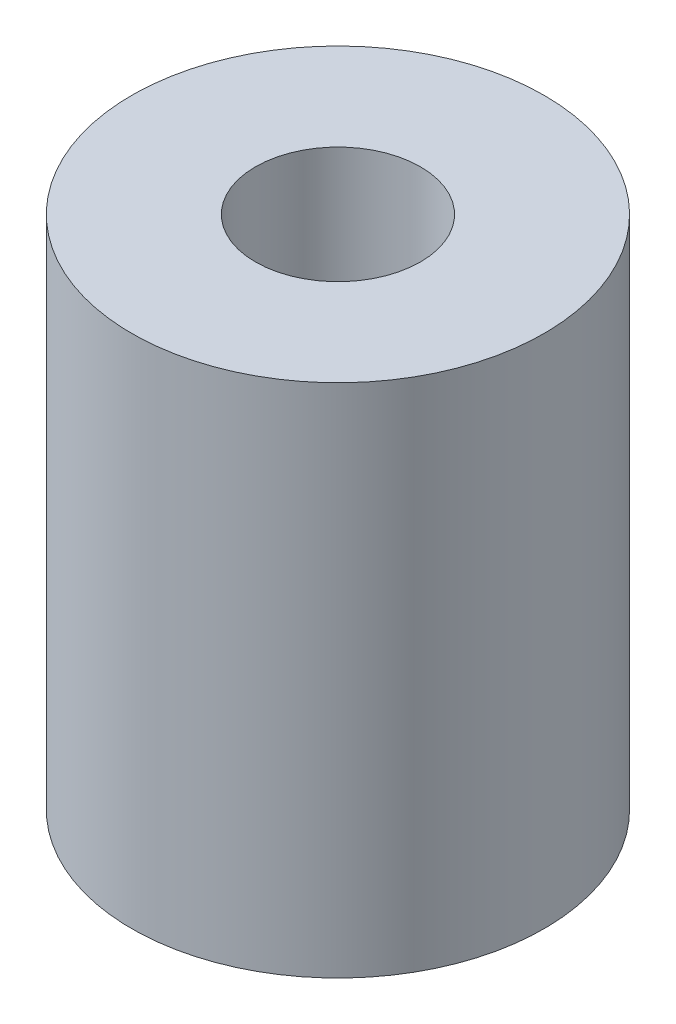
ISO-10303-21;
HEADER;
FILE_DESCRIPTION(('STEP AP214'),'2;1');
FILE_NAME('part.step','',(''),(''),'','','');
FILE_SCHEMA(('AUTOMOTIVE_DESIGN { 1 0 10303 214 1 1 1 1 }'));
ENDSEC;
DATA;
#1=APPLICATION_CONTEXT('core data for automotive mechanical design processes');
#2=APPLICATION_PROTOCOL_DEFINITION('international standard','automotive_design',2000,#1);
#3=PRODUCT_CONTEXT('',#1,'mechanical');
#4=PRODUCT('Part','Part','',(#3));
#5=PRODUCT_RELATED_PRODUCT_CATEGORY('part','',(#4));
#6=PRODUCT_DEFINITION_FORMATION('','',#4);
#7=PRODUCT_DEFINITION_CONTEXT('part definition',#1,'design');
#8=PRODUCT_DEFINITION('design','',#6,#7);
#9=PRODUCT_DEFINITION_SHAPE('','',#8);
#10=(LENGTH_UNIT() NAMED_UNIT(*) SI_UNIT(.MILLI.,.METRE.));
#11=(NAMED_UNIT(*) PLANE_ANGLE_UNIT() SI_UNIT($,.RADIAN.));
#12=(NAMED_UNIT(*) SI_UNIT($,.STERADIAN.) SOLID_ANGLE_UNIT());
#13=UNCERTAINTY_MEASURE_WITH_UNIT(LENGTH_MEASURE(1.E-05),#10,'distance_accuracy_value','');
#14=(GEOMETRIC_REPRESENTATION_CONTEXT(3) GLOBAL_UNCERTAINTY_ASSIGNED_CONTEXT((#13)) GLOBAL_UNIT_ASSIGNED_CONTEXT((#10,
#11,#12)) REPRESENTATION_CONTEXT('',''));
#15=CARTESIAN_POINT('',(0.,0.,0.));
#16=DIRECTION('',(0.,0.,1.));
#17=DIRECTION('',(1.,0.,0.));
#18=AXIS2_PLACEMENT_3D('',#15,#16,#17);
#19=CARTESIAN_POINT('',(0.,16.,0.));
#20=DIRECTION('',(0.,1.,0.));
#21=DIRECTION('',(0.,0.,1.));
#22=AXIS2_PLACEMENT_3D('',#19,#20,#21);
#23=PLANE('',#22);
#24=CARTESIAN_POINT('',(0.,16.,0.));
#25=DIRECTION('',(0.,1.,0.));
#26=DIRECTION('',(0.,0.,1.));
#27=AXIS2_PLACEMENT_3D('',#24,#25,#26);
#28=CIRCLE('',#27,4.);
#29=CARTESIAN_POINT('',(0.,16.,4.));
#30=VERTEX_POINT('',#29);
#31=EDGE_CURVE('E17',#30,#30,#28,.T.);
#32=ORIENTED_EDGE('',*,*,#31,.T.);
#33=EDGE_LOOP('',(#32));
#34=FACE_BOUND('',#33,.T.);
#35=ADVANCED_FACE('F14',(#34),#23,.T.);
#36=CARTESIAN_POINT('',(0.,11.,0.));
#37=DIRECTION('',(0.,-1.,0.));
#38=DIRECTION('',(0.,0.,-1.));
#39=AXIS2_PLACEMENT_3D('',#36,#37,#38);
#40=PLANE('',#39);
#41=CARTESIAN_POINT('',(0.,11.,0.));
#42=DIRECTION('',(0.,-1.,0.));
#43=DIRECTION('',(0.,0.,-1.));
#44=AXIS2_PLACEMENT_3D('',#41,#42,#43);
#45=CIRCLE('',#44,2.5);
#46=CARTESIAN_POINT('',(0.,11.,-2.5));
#47=VERTEX_POINT('',#46);
#48=EDGE_CURVE('E33',#47,#47,#45,.T.);
#49=ORIENTED_EDGE('',*,*,#48,.T.);
#50=EDGE_LOOP('',(#49));
#51=FACE_BOUND('',#50,.T.);
#52=ADVANCED_FACE('F44',(#51),#40,.T.);
#53=CARTESIAN_POINT('',(0.,16.,0.));
#54=DIRECTION('',(0.,1.,0.));
#55=DIRECTION('',(0.,0.,1.));
#56=AXIS2_PLACEMENT_3D('',#53,#54,#55);
#57=CYLINDRICAL_SURFACE('',#56,4.);
#58=CARTESIAN_POINT('',(0.,25.,0.));
#59=DIRECTION('',(0.,1.,0.));
#60=DIRECTION('',(0.,0.,1.));
#61=AXIS2_PLACEMENT_3D('',#58,#59,#60);
#62=CIRCLE('',#61,4.);
#63=CARTESIAN_POINT('',(0.,25.,4.));
#64=VERTEX_POINT('',#63);
#65=EDGE_CURVE('E31',#64,#64,#62,.F.);
#66=ORIENTED_EDGE('',*,*,#65,.F.);
#67=EDGE_LOOP('',(#66));
#68=FACE_BOUND('',#67,.T.);
#69=ORIENTED_EDGE('',*,*,#31,.F.);
#70=EDGE_LOOP('',(#69));
#71=FACE_BOUND('',#70,.T.);
#72=ADVANCED_FACE('F41',(#68,#71),#57,.F.);
#73=CARTESIAN_POINT('',(0.,11.,0.));
#74=DIRECTION('',(0.,-1.,0.));
#75=DIRECTION('',(0.,0.,-1.));
#76=AXIS2_PLACEMENT_3D('',#73,#74,#75);
#77=CYLINDRICAL_SURFACE('',#76,2.5);
#78=ORIENTED_EDGE('',*,*,#48,.F.);
#79=EDGE_LOOP('',(#78));
#80=FACE_BOUND('',#79,.T.);
#81=CARTESIAN_POINT('',(0.,0.,0.));
#82=DIRECTION('',(0.,-1.,0.));
#83=DIRECTION('',(0.,0.,-1.));
#84=AXIS2_PLACEMENT_3D('',#81,#82,#83);
#85=CIRCLE('',#84,2.5);
#86=CARTESIAN_POINT('',(0.,0.,-2.5));
#87=VERTEX_POINT('',#86);
#88=EDGE_CURVE('E26',#87,#87,#85,.T.);
#89=ORIENTED_EDGE('',*,*,#88,.T.);
#90=EDGE_LOOP('',(#89));
#91=FACE_BOUND('',#90,.T.);
#92=ADVANCED_FACE('F43',(#80,#91),#77,.F.);
#93=CARTESIAN_POINT('',(0.,25.,0.));
#94=DIRECTION('',(0.,1.,0.));
#95=DIRECTION('',(0.,0.,1.));
#96=AXIS2_PLACEMENT_3D('',#93,#94,#95);
#97=PLANE('',#96);
#98=CARTESIAN_POINT('',(0.,25.,0.));
#99=DIRECTION('',(0.,-1.,0.));
#100=DIRECTION('',(0.,0.,-1.));
#101=AXIS2_PLACEMENT_3D('',#98,#99,#100);
#102=CIRCLE('',#101,10.);
#103=CARTESIAN_POINT('',(0.,25.,-10.));
#104=VERTEX_POINT('',#103);
#105=EDGE_CURVE('E21',#104,#104,#102,.T.);
#106=ORIENTED_EDGE('',*,*,#105,.F.);
#107=EDGE_LOOP('',(#106));
#108=FACE_BOUND('',#107,.T.);
#109=ORIENTED_EDGE('',*,*,#65,.T.);
#110=EDGE_LOOP('',(#109));
#111=FACE_BOUND('',#110,.T.);
#112=ADVANCED_FACE('F52',(#108,#111),#97,.T.);
#113=CARTESIAN_POINT('',(0.,0.,0.));
#114=DIRECTION('',(0.,1.,0.));
#115=DIRECTION('',(0.,0.,1.));
#116=AXIS2_PLACEMENT_3D('',#113,#114,#115);
#117=PLANE('',#116);
#118=CARTESIAN_POINT('',(0.,0.,0.));
#119=DIRECTION('',(0.,-1.,0.));
#120=DIRECTION('',(0.,0.,-1.));
#121=AXIS2_PLACEMENT_3D('',#118,#119,#120);
#122=CIRCLE('',#121,10.);
#123=CARTESIAN_POINT('',(0.,0.,-10.));
#124=VERTEX_POINT('',#123);
#125=EDGE_CURVE('E10',#124,#124,#122,.F.);
#126=ORIENTED_EDGE('',*,*,#125,.F.);
#127=EDGE_LOOP('',(#126));
#128=FACE_BOUND('',#127,.T.);
#129=ORIENTED_EDGE('',*,*,#88,.F.);
#130=EDGE_LOOP('',(#129));
#131=FACE_BOUND('',#130,.T.);
#132=ADVANCED_FACE('F58',(#128,#131),#117,.F.);
#133=CARTESIAN_POINT('',(0.,25.,0.));
#134=DIRECTION('',(0.,-1.,0.));
#135=DIRECTION('',(0.,0.,-1.));
#136=AXIS2_PLACEMENT_3D('',#133,#134,#135);
#137=CYLINDRICAL_SURFACE('',#136,10.);
#138=ORIENTED_EDGE('',*,*,#125,.T.);
#139=EDGE_LOOP('',(#138));
#140=FACE_BOUND('',#139,.T.);
#141=ORIENTED_EDGE('',*,*,#105,.T.);
#142=EDGE_LOOP('',(#141));
#143=FACE_BOUND('',#142,.T.);
#144=ADVANCED_FACE('F56',(#140,#143),#137,.T.);
#145=CLOSED_SHELL('',(#35,#52,#72,#92,#112,#132,#144));
#146=MANIFOLD_SOLID_BREP('B1',#145);
#147=ADVANCED_BREP_SHAPE_REPRESENTATION('',(#18,#146),#14);
#148=SHAPE_DEFINITION_REPRESENTATION(#9,#147);
ENDSEC;
END-ISO-10303-21;
